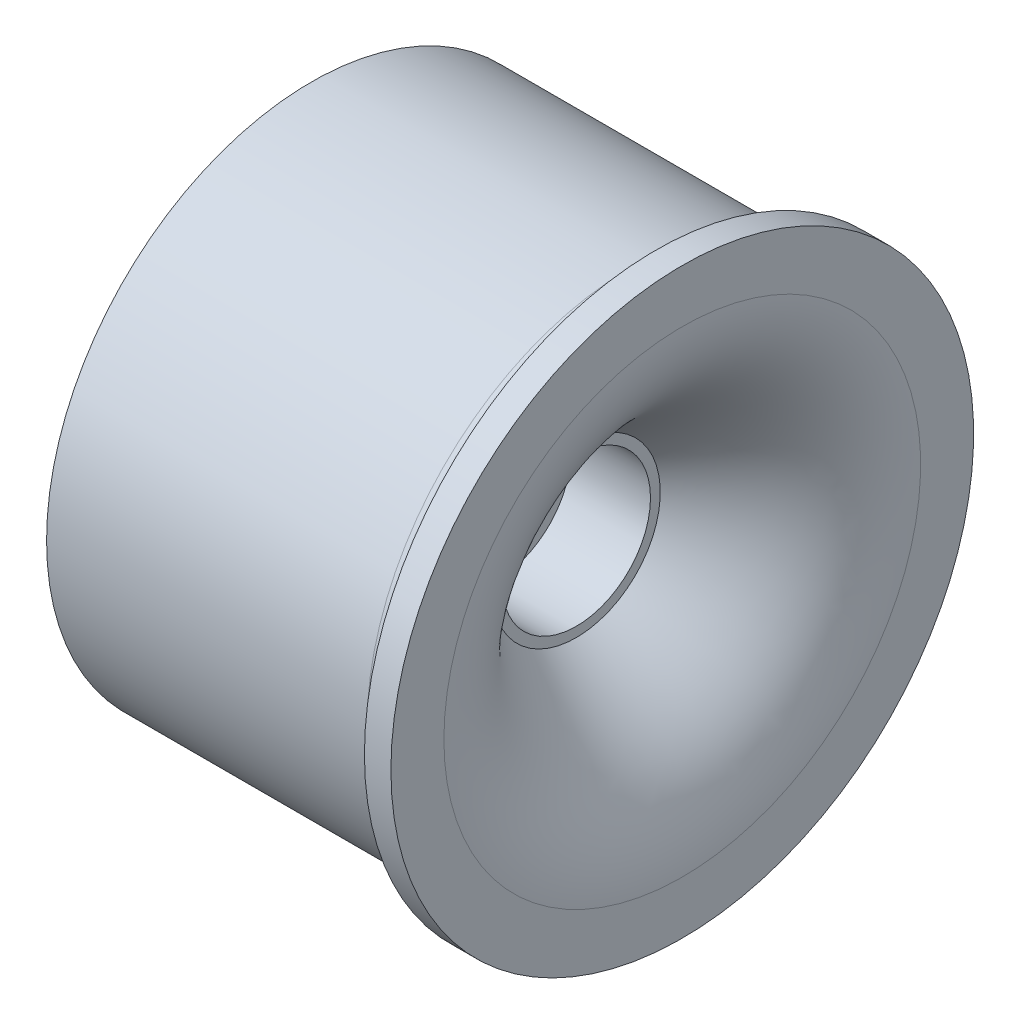
ISO-10303-21;
HEADER;
FILE_DESCRIPTION(('STEP AP214'),'2;1');
FILE_NAME('part.step','',(''),(''),'','','');
FILE_SCHEMA(('AUTOMOTIVE_DESIGN { 1 0 10303 214 1 1 1 1 }'));
ENDSEC;
DATA;
#1=APPLICATION_CONTEXT('core data for automotive mechanical design processes');
#2=APPLICATION_PROTOCOL_DEFINITION('international standard','automotive_design',2000,#1);
#3=PRODUCT_CONTEXT('',#1,'mechanical');
#4=PRODUCT('Part','Part','',(#3));
#5=PRODUCT_RELATED_PRODUCT_CATEGORY('part','',(#4));
#6=PRODUCT_DEFINITION_FORMATION('','',#4);
#7=PRODUCT_DEFINITION_CONTEXT('part definition',#1,'design');
#8=PRODUCT_DEFINITION('design','',#6,#7);
#9=PRODUCT_DEFINITION_SHAPE('','',#8);
#10=(LENGTH_UNIT() NAMED_UNIT(*) SI_UNIT(.MILLI.,.METRE.));
#11=(NAMED_UNIT(*) PLANE_ANGLE_UNIT() SI_UNIT($,.RADIAN.));
#12=(NAMED_UNIT(*) SI_UNIT($,.STERADIAN.) SOLID_ANGLE_UNIT());
#13=UNCERTAINTY_MEASURE_WITH_UNIT(LENGTH_MEASURE(1.E-05),#10,'distance_accuracy_value','');
#14=(GEOMETRIC_REPRESENTATION_CONTEXT(3) GLOBAL_UNCERTAINTY_ASSIGNED_CONTEXT((#13)) GLOBAL_UNIT_ASSIGNED_CONTEXT((#10,
#11,#12)) REPRESENTATION_CONTEXT('',''));
#15=CARTESIAN_POINT('',(0.,0.,0.));
#16=DIRECTION('',(0.,0.,1.));
#17=DIRECTION('',(1.,0.,0.));
#18=AXIS2_PLACEMENT_3D('',#15,#16,#17);
#19=CARTESIAN_POINT('',(-7.,9.,0.));
#20=DIRECTION('',(1.,0.,0.));
#21=DIRECTION('',(0.,0.,-1.));
#22=AXIS2_PLACEMENT_3D('',#19,#20,#21);
#23=PLANE('',#22);
#24=CARTESIAN_POINT('',(-7.,0.,0.));
#25=DIRECTION('',(-1.,0.,0.));
#26=DIRECTION('',(0.,0.,1.));
#27=AXIS2_PLACEMENT_3D('',#24,#25,#26);
#28=CIRCLE('',#27,9.);
#29=CARTESIAN_POINT('',(-7.,0.,9.));
#30=VERTEX_POINT('',#29);
#31=EDGE_CURVE('E37',#30,#30,#28,.T.);
#32=ORIENTED_EDGE('',*,*,#31,.F.);
#33=EDGE_LOOP('',(#32));
#34=FACE_BOUND('',#33,.T.);
#35=CARTESIAN_POINT('',(-7.,0.,0.));
#36=DIRECTION('',(1.,0.,0.));
#37=DIRECTION('',(0.,0.,-1.));
#38=AXIS2_PLACEMENT_3D('',#35,#36,#37);
#39=CIRCLE('',#38,10.);
#40=CARTESIAN_POINT('',(-7.,0.,-10.));
#41=VERTEX_POINT('',#40);
#42=EDGE_CURVE('E100',#41,#41,#39,.T.);
#43=ORIENTED_EDGE('',*,*,#42,.F.);
#44=EDGE_LOOP('',(#43));
#45=FACE_BOUND('',#44,.T.);
#46=ADVANCED_FACE('F30',(#34,#45),#23,.F.);
#47=CARTESIAN_POINT('',(0.,1.,0.));
#48=CARTESIAN_POINT('',(0.00160792992886978,1.00138739170107,0.));
#49=CARTESIAN_POINT('',(5.45120079220063,4.58178745545136,0.));
#50=CARTESIAN_POINT('',(7.,7.4379916864502,0.));
#51=CARTESIAN_POINT('',(7.,9.,0.));
#52=B_SPLINE_CURVE_WITH_KNOTS('',3,(#47,#48,#49,#50,#51),.UNSPECIFIED.,.F.,.F.,(4,1,4),(0.,
0.594098358034036,1.),.UNSPECIFIED.);
#53=CARTESIAN_POINT('',(0.,0.,0.));
#54=DIRECTION('',(-1.,0.,0.));
#55=AXIS1_PLACEMENT('',#53,#54);
#56=SURFACE_OF_REVOLUTION('',#52,#55);
#57=CARTESIAN_POINT('',(7.,0.,0.));
#58=DIRECTION('',(-1.,0.,0.));
#59=DIRECTION('',(0.,0.,1.));
#60=AXIS2_PLACEMENT_3D('',#57,#58,#59);
#61=CIRCLE('',#60,9.);
#62=CARTESIAN_POINT('',(7.,0.,9.));
#63=VERTEX_POINT('',#62);
#64=EDGE_CURVE('E46',#63,#63,#61,.T.);
#65=ORIENTED_EDGE('',*,*,#64,.F.);
#66=EDGE_LOOP('',(#65));
#67=FACE_BOUND('',#66,.T.);
#68=CARTESIAN_POINT('',(3.,0.,0.));
#69=DIRECTION('',(-1.,0.,0.));
#70=DIRECTION('',(0.,0.,1.));
#71=AXIS2_PLACEMENT_3D('',#68,#69,#70);
#72=CIRCLE('',#71,3.16989776843226);
#73=CARTESIAN_POINT('',(3.,0.,3.16989776843226));
#74=VERTEX_POINT('',#73);
#75=EDGE_CURVE('E10',#74,#74,#72,.F.);
#76=ORIENTED_EDGE('',*,*,#75,.F.);
#77=EDGE_LOOP('',(#76));
#78=FACE_BOUND('',#77,.T.);
#79=ADVANCED_FACE('F73',(#67,#78),#56,.T.);
#80=CARTESIAN_POINT('',(0.,0.,0.));
#81=DIRECTION('',(-1.,0.,0.));
#82=DIRECTION('',(0.,0.,1.));
#83=AXIS2_PLACEMENT_3D('',#80,#81,#82);
#84=CYLINDRICAL_SURFACE('',#83,9.);
#85=CARTESIAN_POINT('',(5.,0.,0.));
#86=DIRECTION('',(-1.,0.,0.));
#87=DIRECTION('',(0.,0.,1.));
#88=AXIS2_PLACEMENT_3D('',#85,#86,#87);
#89=CIRCLE('',#88,9.);
#90=CARTESIAN_POINT('',(5.,0.,9.));
#91=VERTEX_POINT('',#90);
#92=EDGE_CURVE('E41',#91,#91,#89,.T.);
#93=ORIENTED_EDGE('',*,*,#92,.F.);
#94=EDGE_LOOP('',(#93));
#95=FACE_BOUND('',#94,.T.);
#96=ORIENTED_EDGE('',*,*,#31,.T.);
#97=EDGE_LOOP('',(#96));
#98=FACE_BOUND('',#97,.T.);
#99=ADVANCED_FACE('F77',(#95,#98),#84,.F.);
#100=CARTESIAN_POINT('',(5.,9.,0.));
#101=CARTESIAN_POINT('',(5.,8.85646618108362,0.));
#102=CARTESIAN_POINT('',(4.98063038521978,8.55263811119017,0.));
#103=CARTESIAN_POINT('',(4.87985688524672,8.08590643693265,0.));
#104=CARTESIAN_POINT('',(4.63754059279625,7.52830638942739,0.));
#105=CARTESIAN_POINT('',(3.99604958420203,6.6901603503502,0.));
#106=CARTESIAN_POINT('',(2.8609723497715,5.61874778312995,0.));
#107=CARTESIAN_POINT('',(1.47846521100652,4.5039974350811,0.));
#108=CARTESIAN_POINT('',(0.377556202207689,3.69355261378006,0.));
#109=CARTESIAN_POINT('',(-0.34028519152994,3.1869641454394,0.));
#110=CARTESIAN_POINT('',(-0.693084828249365,2.94425750190692,0.));
#111=CARTESIAN_POINT('',(-0.901467231533146,2.80299115463034,0.));
#112=CARTESIAN_POINT('',(-0.997540168809837,2.73850883271359,0.));
#113=CARTESIAN_POINT('',(-1.05195522796495,2.70220778551082,0.));
#114=CARTESIAN_POINT('',(-1.07624385229185,2.6860729401472,0.));
#115=CARTESIAN_POINT('',(-1.08978288653604,2.67710083303478,0.));
#116=CARTESIAN_POINT('',(-1.09584836897003,2.67308736122119,0.));
#117=CARTESIAN_POINT('',(-1.09961279892132,2.67059742277568,0.));
#118=CARTESIAN_POINT('',(-1.10172833125618,2.66919814788139,0.));
#119=CARTESIAN_POINT('',(-1.10400339389887,2.66769116974703,0.));
#120=CARTESIAN_POINT('',(-1.10610870933588,2.66629513123715,0.));
#121=CARTESIAN_POINT('',(-1.10953470801638,2.66401492936108,0.));
#122=CARTESIAN_POINT('',(-1.11326395257081,2.66152284124609,0.));
#123=CARTESIAN_POINT('',(-1.11942562888526,2.65738258530016,0.));
#124=CARTESIAN_POINT('',(-1.12625662965937,2.65274054162686,0.));
#125=CARTESIAN_POINT('',(-1.13652065325991,2.64573433559375,0.));
#126=CARTESIAN_POINT('',(-1.1505718295726,2.63587219155509,0.));
#127=CARTESIAN_POINT('',(-1.17023538922601,2.62221806968977,0.));
#128=CARTESIAN_POINT('',(-1.20976663416232,2.59271164120457,0.));
#129=CARTESIAN_POINT('',(-1.24558938964458,2.56517397813091,0.));
#130=CARTESIAN_POINT('',(-1.28859496429067,2.52973381019773,0.));
#131=CARTESIAN_POINT('',(-1.30655183237489,2.51423984537385,0.));
#132=B_SPLINE_CURVE_WITH_KNOTS('',3,(#100,#101,#102,#103,#104,#105,#106,#107,#108,#109,#110,
#111,#112,#113,#114,#115,#116,#117,#118,#119,#120,#121,#122,#123,#124,#125,#126,#127,#128,#129,
#130,#131),.UNSPECIFIED.,.F.,.F.,(4,1,1,1,1,1,1,1,1,1,1,1,1,1,1,1,1,1,1,1,1,1,1,1,1,1,1,1,1,4),
(0.,0.0625,0.125,0.25,0.375,0.5,0.625,0.75,0.8125,0.875,0.90625,0.9375,0.953125,0.96875,
0.9765625,0.984375,0.98828125,0.9921875,0.994140625,0.99609375,0.9970703125,0.998046875,
0.99853515625,0.9990234375,0.999267578125,0.99951171875,0.999755859375,0.9998779296875,
0.99993896484375,1.),.UNSPECIFIED.);
#133=CARTESIAN_POINT('',(0.,0.,0.));
#134=DIRECTION('',(-1.,0.,0.));
#135=AXIS1_PLACEMENT('',#133,#134);
#136=SURFACE_OF_REVOLUTION('',#132,#135);
#137=CARTESIAN_POINT('',(2.69029431724692,0.,0.));
#138=DIRECTION('',(-1.,0.,0.));
#139=DIRECTION('',(0.,0.,1.));
#140=AXIS2_PLACEMENT_3D('',#137,#138,#139);
#141=CIRCLE('',#140,5.5);
#142=CARTESIAN_POINT('',(2.69029431724692,0.,5.5));
#143=VERTEX_POINT('',#142);
#144=EDGE_CURVE('E33',#143,#143,#141,.F.);
#145=ORIENTED_EDGE('',*,*,#144,.T.);
#146=EDGE_LOOP('',(#145));
#147=FACE_BOUND('',#146,.T.);
#148=ORIENTED_EDGE('',*,*,#92,.T.);
#149=EDGE_LOOP('',(#148));
#150=FACE_BOUND('',#149,.T.);
#151=ADVANCED_FACE('F81',(#147,#150),#136,.T.);
#152=CARTESIAN_POINT('',(7.,9.,0.));
#153=DIRECTION('',(-1.,0.,0.));
#154=DIRECTION('',(0.,0.,1.));
#155=AXIS2_PLACEMENT_3D('',#152,#153,#154);
#156=PLANE('',#155);
#157=CARTESIAN_POINT('',(7.,0.,0.));
#158=DIRECTION('',(-1.,0.,0.));
#159=DIRECTION('',(0.,0.,1.));
#160=AXIS2_PLACEMENT_3D('',#157,#158,#159);
#161=CIRCLE('',#160,11.);
#162=CARTESIAN_POINT('',(7.,0.,11.));
#163=VERTEX_POINT('',#162);
#164=EDGE_CURVE('E49',#163,#163,#161,.T.);
#165=ORIENTED_EDGE('',*,*,#164,.F.);
#166=EDGE_LOOP('',(#165));
#167=FACE_BOUND('',#166,.T.);
#168=ORIENTED_EDGE('',*,*,#64,.T.);
#169=EDGE_LOOP('',(#168));
#170=FACE_BOUND('',#169,.T.);
#171=ADVANCED_FACE('F79',(#167,#170),#156,.F.);
#172=CARTESIAN_POINT('',(0.,0.,0.));
#173=DIRECTION('',(-1.,0.,0.));
#174=DIRECTION('',(0.,0.,1.));
#175=AXIS2_PLACEMENT_3D('',#172,#173,#174);
#176=CYLINDRICAL_SURFACE('',#175,11.);
#177=CARTESIAN_POINT('',(6.,0.,0.));
#178=DIRECTION('',(-1.,0.,0.));
#179=DIRECTION('',(0.,0.,1.));
#180=AXIS2_PLACEMENT_3D('',#177,#178,#179);
#181=CIRCLE('',#180,11.);
#182=CARTESIAN_POINT('',(6.,0.,11.));
#183=VERTEX_POINT('',#182);
#184=EDGE_CURVE('E52',#183,#183,#181,.T.);
#185=ORIENTED_EDGE('',*,*,#184,.F.);
#186=EDGE_LOOP('',(#185));
#187=FACE_BOUND('',#186,.T.);
#188=ORIENTED_EDGE('',*,*,#164,.T.);
#189=EDGE_LOOP('',(#188));
#190=FACE_BOUND('',#189,.T.);
#191=ADVANCED_FACE('F146',(#187,#190),#176,.T.);
#192=CARTESIAN_POINT('',(6.,11.,0.));
#193=DIRECTION('',(1.,0.,0.));
#194=DIRECTION('',(0.,0.,-1.));
#195=AXIS2_PLACEMENT_3D('',#192,#193,#194);
#196=PLANE('',#195);
#197=CARTESIAN_POINT('',(6.,0.,0.));
#198=DIRECTION('',(-1.,0.,0.));
#199=DIRECTION('',(0.,0.,1.));
#200=AXIS2_PLACEMENT_3D('',#197,#198,#199);
#201=CIRCLE('',#200,10.9);
#202=CARTESIAN_POINT('',(6.,0.,10.9));
#203=VERTEX_POINT('',#202);
#204=EDGE_CURVE('E55',#203,#203,#201,.T.);
#205=ORIENTED_EDGE('',*,*,#204,.F.);
#206=EDGE_LOOP('',(#205));
#207=FACE_BOUND('',#206,.T.);
#208=ORIENTED_EDGE('',*,*,#184,.T.);
#209=EDGE_LOOP('',(#208));
#210=FACE_BOUND('',#209,.T.);
#211=ADVANCED_FACE('F143',(#207,#210),#196,.F.);
#212=CARTESIAN_POINT('',(5.1,0.,0.));
#213=DIRECTION('',(-1.,0.,0.));
#214=DIRECTION('',(0.,0.,1.));
#215=AXIS2_PLACEMENT_3D('',#212,#213,#214);
#216=TOROIDAL_SURFACE('',#215,10.9,0.900000000000001);
#217=CARTESIAN_POINT('',(5.1,0.,0.));
#218=DIRECTION('',(-1.,0.,0.));
#219=DIRECTION('',(0.,0.,1.));
#220=AXIS2_PLACEMENT_3D('',#217,#218,#219);
#221=CIRCLE('',#220,10.);
#222=CARTESIAN_POINT('',(5.1,0.,10.));
#223=VERTEX_POINT('',#222);
#224=EDGE_CURVE('E58',#223,#223,#221,.T.);
#225=ORIENTED_EDGE('',*,*,#224,.F.);
#226=EDGE_LOOP('',(#225));
#227=FACE_BOUND('',#226,.T.);
#228=ORIENTED_EDGE('',*,*,#204,.T.);
#229=EDGE_LOOP('',(#228));
#230=FACE_BOUND('',#229,.T.);
#231=ADVANCED_FACE('F137',(#227,#230),#216,.F.);
#232=CARTESIAN_POINT('',(0.,0.,0.));
#233=DIRECTION('',(-1.,0.,0.));
#234=DIRECTION('',(0.,0.,1.));
#235=AXIS2_PLACEMENT_3D('',#232,#233,#234);
#236=CYLINDRICAL_SURFACE('',#235,10.);
#237=ORIENTED_EDGE('',*,*,#224,.T.);
#238=EDGE_LOOP('',(#237));
#239=FACE_BOUND('',#238,.T.);
#240=ORIENTED_EDGE('',*,*,#42,.T.);
#241=EDGE_LOOP('',(#240));
#242=FACE_BOUND('',#241,.T.);
#243=ADVANCED_FACE('F126',(#239,#242),#236,.T.);
#244=CARTESIAN_POINT('',(3.,0.,0.));
#245=DIRECTION('',(-1.,0.,0.));
#246=DIRECTION('',(0.,0.,1.));
#247=AXIS2_PLACEMENT_3D('',#244,#245,#246);
#248=CYLINDRICAL_SURFACE('',#247,5.5);
#249=CARTESIAN_POINT('',(-7.,0.,0.));
#250=DIRECTION('',(-1.,0.,0.));
#251=DIRECTION('',(0.,0.,1.));
#252=AXIS2_PLACEMENT_3D('',#249,#250,#251);
#253=CIRCLE('',#252,5.5);
#254=CARTESIAN_POINT('',(-7.,0.,5.5));
#255=VERTEX_POINT('',#254);
#256=EDGE_CURVE('E114',#255,#255,#253,.T.);
#257=ORIENTED_EDGE('',*,*,#256,.F.);
#258=EDGE_LOOP('',(#257));
#259=FACE_BOUND('',#258,.T.);
#260=ORIENTED_EDGE('',*,*,#144,.F.);
#261=EDGE_LOOP('',(#260));
#262=FACE_BOUND('',#261,.T.);
#263=ADVANCED_FACE('F123',(#259,#262),#248,.T.);
#264=CARTESIAN_POINT('',(3.,0.,0.));
#265=DIRECTION('',(-1.,0.,0.));
#266=DIRECTION('',(0.,0.,1.));
#267=AXIS2_PLACEMENT_3D('',#264,#265,#266);
#268=PLANE('',#267);
#269=CARTESIAN_POINT('',(3.,0.,0.));
#270=DIRECTION('',(1.,0.,0.));
#271=DIRECTION('',(0.,0.,-1.));
#272=AXIS2_PLACEMENT_3D('',#269,#270,#271);
#273=CIRCLE('',#272,2.8);
#274=CARTESIAN_POINT('',(3.,0.,-2.8));
#275=VERTEX_POINT('',#274);
#276=EDGE_CURVE('E109',#275,#275,#273,.T.);
#277=ORIENTED_EDGE('',*,*,#276,.F.);
#278=EDGE_LOOP('',(#277));
#279=FACE_BOUND('',#278,.T.);
#280=ORIENTED_EDGE('',*,*,#75,.T.);
#281=EDGE_LOOP('',(#280));
#282=FACE_BOUND('',#281,.T.);
#283=ADVANCED_FACE('F125',(#279,#282),#268,.F.);
#284=CARTESIAN_POINT('',(-7.,0.,0.));
#285=DIRECTION('',(-1.,0.,0.));
#286=DIRECTION('',(0.,0.,1.));
#287=AXIS2_PLACEMENT_3D('',#284,#285,#286);
#288=PLANE('',#287);
#289=CARTESIAN_POINT('',(-7.,0.,0.));
#290=DIRECTION('',(-1.,0.,0.));
#291=DIRECTION('',(0.,0.,1.));
#292=AXIS2_PLACEMENT_3D('',#289,#290,#291);
#293=CIRCLE('',#292,1.42);
#294=CARTESIAN_POINT('',(-7.,0.,1.42));
#295=VERTEX_POINT('',#294);
#296=EDGE_CURVE('E102',#295,#295,#293,.T.);
#297=ORIENTED_EDGE('',*,*,#296,.F.);
#298=EDGE_LOOP('',(#297));
#299=FACE_BOUND('',#298,.T.);
#300=ORIENTED_EDGE('',*,*,#256,.T.);
#301=EDGE_LOOP('',(#300));
#302=FACE_BOUND('',#301,.T.);
#303=ADVANCED_FACE('F133',(#299,#302),#288,.T.);
#304=CARTESIAN_POINT('',(0.,0.,0.));
#305=DIRECTION('',(1.,0.,0.));
#306=DIRECTION('',(0.,0.,-1.));
#307=AXIS2_PLACEMENT_3D('',#304,#305,#306);
#308=PLANE('',#307);
#309=CARTESIAN_POINT('',(0.,0.,0.));
#310=DIRECTION('',(-1.,0.,0.));
#311=DIRECTION('',(0.,0.,1.));
#312=AXIS2_PLACEMENT_3D('',#309,#310,#311);
#313=CIRCLE('',#312,1.42);
#314=CARTESIAN_POINT('',(0.,0.,1.42));
#315=VERTEX_POINT('',#314);
#316=EDGE_CURVE('E105',#315,#315,#313,.T.);
#317=ORIENTED_EDGE('',*,*,#316,.T.);
#318=EDGE_LOOP('',(#317));
#319=FACE_BOUND('',#318,.T.);
#320=CARTESIAN_POINT('',(0.,0.,0.));
#321=DIRECTION('',(1.,0.,0.));
#322=DIRECTION('',(0.,0.,-1.));
#323=AXIS2_PLACEMENT_3D('',#320,#321,#322);
#324=CIRCLE('',#323,2.8);
#325=CARTESIAN_POINT('',(0.,0.,-2.8));
#326=VERTEX_POINT('',#325);
#327=EDGE_CURVE('E111',#326,#326,#324,.T.);
#328=ORIENTED_EDGE('',*,*,#327,.T.);
#329=EDGE_LOOP('',(#328));
#330=FACE_BOUND('',#329,.T.);
#331=ADVANCED_FACE('F195',(#319,#330),#308,.T.);
#332=CARTESIAN_POINT('',(0.,0.,0.));
#333=DIRECTION('',(1.,0.,0.));
#334=DIRECTION('',(0.,0.,-1.));
#335=AXIS2_PLACEMENT_3D('',#332,#333,#334);
#336=CYLINDRICAL_SURFACE('',#335,2.8);
#337=ORIENTED_EDGE('',*,*,#327,.F.);
#338=EDGE_LOOP('',(#337));
#339=FACE_BOUND('',#338,.T.);
#340=ORIENTED_EDGE('',*,*,#276,.T.);
#341=EDGE_LOOP('',(#340));
#342=FACE_BOUND('',#341,.T.);
#343=ADVANCED_FACE('F189',(#339,#342),#336,.F.);
#344=CARTESIAN_POINT('',(0.,0.,0.));
#345=DIRECTION('',(-1.,0.,0.));
#346=DIRECTION('',(0.,0.,1.));
#347=AXIS2_PLACEMENT_3D('',#344,#345,#346);
#348=CYLINDRICAL_SURFACE('',#347,1.42);
#349=CARTESIAN_POINT('',(0.,0.,1.42));
#350=CARTESIAN_POINT('',(-0.0729166666666676,0.,1.42));
#351=CARTESIAN_POINT('',(-0.145833333333334,0.,1.42));
#352=CARTESIAN_POINT('',(-0.291666666666667,0.,1.42));
#353=CARTESIAN_POINT('',(-0.364583333333334,0.,1.42));
#354=CARTESIAN_POINT('',(-0.510416666666667,0.,1.42));
#355=CARTESIAN_POINT('',(-0.583333333333334,0.,1.42));
#356=CARTESIAN_POINT('',(-0.729166666666667,0.,1.42));
#357=CARTESIAN_POINT('',(-0.802083333333334,0.,1.42));
#358=CARTESIAN_POINT('',(-0.947916666666667,0.,1.42));
#359=CARTESIAN_POINT('',(-1.02083333333333,0.,1.42));
#360=CARTESIAN_POINT('',(-1.16666666666667,0.,1.42));
#361=CARTESIAN_POINT('',(-1.23958333333333,0.,1.42));
#362=CARTESIAN_POINT('',(-1.38541666666667,0.,1.42));
#363=CARTESIAN_POINT('',(-1.45833333333333,0.,1.42));
#364=CARTESIAN_POINT('',(-1.60416666666667,0.,1.42));
#365=CARTESIAN_POINT('',(-1.67708333333333,0.,1.42));
#366=CARTESIAN_POINT('',(-1.82291666666667,0.,1.42));
#367=CARTESIAN_POINT('',(-1.89583333333333,0.,1.42));
#368=CARTESIAN_POINT('',(-2.04166666666667,0.,1.42));
#369=CARTESIAN_POINT('',(-2.11458333333333,0.,1.42));
#370=CARTESIAN_POINT('',(-2.26041666666667,0.,1.42));
#371=CARTESIAN_POINT('',(-2.33333333333333,0.,1.42));
#372=CARTESIAN_POINT('',(-2.47916666666667,0.,1.42));
#373=CARTESIAN_POINT('',(-2.55208333333333,0.,1.42));
#374=CARTESIAN_POINT('',(-2.69791666666667,0.,1.42));
#375=CARTESIAN_POINT('',(-2.77083333333333,0.,1.42));
#376=CARTESIAN_POINT('',(-2.91666666666667,0.,1.42));
#377=CARTESIAN_POINT('',(-2.98958333333333,0.,1.42));
#378=CARTESIAN_POINT('',(-3.13541666666667,0.,1.42));
#379=CARTESIAN_POINT('',(-3.20833333333333,0.,1.42));
#380=CARTESIAN_POINT('',(-3.35416666666667,0.,1.42));
#381=CARTESIAN_POINT('',(-3.42708333333333,0.,1.42));
#382=CARTESIAN_POINT('',(-3.57291666666667,0.,1.42));
#383=CARTESIAN_POINT('',(-3.64583333333333,0.,1.42));
#384=CARTESIAN_POINT('',(-3.79166666666667,0.,1.42));
#385=CARTESIAN_POINT('',(-3.86458333333333,0.,1.42));
#386=CARTESIAN_POINT('',(-4.01041666666667,0.,1.42));
#387=CARTESIAN_POINT('',(-4.08333333333333,0.,1.42));
#388=CARTESIAN_POINT('',(-4.22916666666667,0.,1.42));
#389=CARTESIAN_POINT('',(-4.30208333333333,0.,1.42));
#390=CARTESIAN_POINT('',(-4.44791666666667,0.,1.42));
#391=CARTESIAN_POINT('',(-4.52083333333333,0.,1.42));
#392=CARTESIAN_POINT('',(-4.66666666666667,0.,1.42));
#393=CARTESIAN_POINT('',(-4.73958333333333,0.,1.42));
#394=CARTESIAN_POINT('',(-4.88541666666667,0.,1.42));
#395=CARTESIAN_POINT('',(-4.95833333333333,0.,1.42));
#396=CARTESIAN_POINT('',(-5.10416666666667,0.,1.42));
#397=CARTESIAN_POINT('',(-5.17708333333333,0.,1.42));
#398=CARTESIAN_POINT('',(-5.32291666666667,0.,1.42));
#399=CARTESIAN_POINT('',(-5.39583333333333,0.,1.42));
#400=CARTESIAN_POINT('',(-5.54166666666667,0.,1.42));
#401=CARTESIAN_POINT('',(-5.61458333333333,0.,1.42));
#402=CARTESIAN_POINT('',(-5.76041666666667,0.,1.42));
#403=CARTESIAN_POINT('',(-5.83333333333333,0.,1.42));
#404=CARTESIAN_POINT('',(-5.97916666666667,0.,1.42));
#405=CARTESIAN_POINT('',(-6.05208333333333,0.,1.42));
#406=CARTESIAN_POINT('',(-6.19791666666667,0.,1.42));
#407=CARTESIAN_POINT('',(-6.27083333333333,0.,1.42));
#408=CARTESIAN_POINT('',(-6.41666666666667,0.,1.42));
#409=CARTESIAN_POINT('',(-6.48958333333333,0.,1.42));
#410=CARTESIAN_POINT('',(-6.63541666666667,0.,1.42));
#411=CARTESIAN_POINT('',(-6.70833333333333,0.,1.42));
#412=CARTESIAN_POINT('',(-6.85416666666667,0.,1.42));
#413=CARTESIAN_POINT('',(-6.92708333333333,0.,1.42));
#414=CARTESIAN_POINT('',(-7.,0.,1.42));
#415=B_SPLINE_CURVE_WITH_KNOTS('',3,(#349,#350,#351,#352,#353,#354,#355,#356,#357,#358,#359,
#360,#361,#362,#363,#364,#365,#366,#367,#368,#369,#370,#371,#372,#373,#374,#375,#376,#377,#378,
#379,#380,#381,#382,#383,#384,#385,#386,#387,#388,#389,#390,#391,#392,#393,#394,#395,#396,#397,
#398,#399,#400,#401,#402,#403,#404,#405,#406,#407,#408,#409,#410,#411,#412,#413,#414),
.UNSPECIFIED.,.F.,.F.,(4,2,2,2,2,2,2,2,2,2,2,2,2,2,2,2,2,2,2,2,2,2,2,2,2,2,2,2,2,2,2,2,4),(0.,
0.21875,0.4375,0.65625,0.875,1.09375,1.3125,1.53125,1.75,1.96875,2.1875,2.40625,2.625,2.84375,
3.0625,3.28125,3.5,3.71875,3.9375,4.15625,4.375,4.59375,4.8125,5.03125,5.25,5.46875,5.6875,
5.90625,6.125,6.34375,6.5625,6.78125,7.),.UNSPECIFIED.);
#416=EDGE_CURVE('BSEAM194',#315,#295,#415,.T.);
#417=ORIENTED_EDGE('',*,*,#316,.F.);
#418=ORIENTED_EDGE('',*,*,#296,.T.);
#419=ORIENTED_EDGE('',*,*,#416,.T.);
#420=ORIENTED_EDGE('',*,*,#416,.F.);
#421=EDGE_LOOP('',(#417,#419,#418,#420));
#422=FACE_BOUND('',#421,.T.);
#423=ADVANCED_FACE('F194',(#422),#348,.F.);
#424=CLOSED_SHELL('',(#46,#79,#99,#151,#171,#191,#211,#231,#243,#263,#283,#303,#331,#343,#423));
#425=MANIFOLD_SOLID_BREP('B2',#424);
#426=ADVANCED_BREP_SHAPE_REPRESENTATION('',(#18,#425),#14);
#427=SHAPE_DEFINITION_REPRESENTATION(#9,#426);
ENDSEC;
END-ISO-10303-21;
